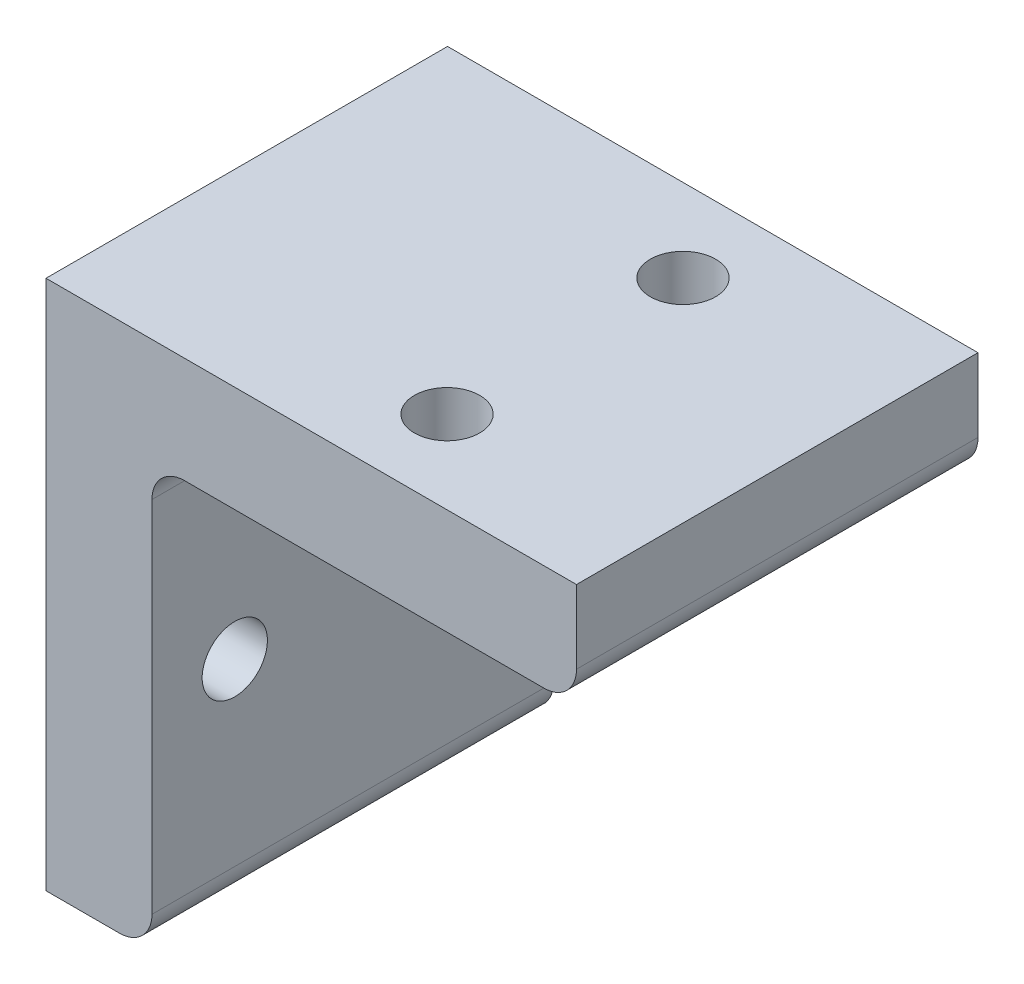
ISO-10303-21;
HEADER;
FILE_DESCRIPTION(('STEP AP214'),'2;1');
FILE_NAME('part.step','',(''),(''),'','','');
FILE_SCHEMA(('AUTOMOTIVE_DESIGN { 1 0 10303 214 1 1 1 1 }'));
ENDSEC;
DATA;
#1=APPLICATION_CONTEXT('core data for automotive mechanical design processes');
#2=APPLICATION_PROTOCOL_DEFINITION('international standard','automotive_design',2000,#1);
#3=PRODUCT_CONTEXT('',#1,'mechanical');
#4=PRODUCT('Part','Part','',(#3));
#5=PRODUCT_RELATED_PRODUCT_CATEGORY('part','',(#4));
#6=PRODUCT_DEFINITION_FORMATION('','',#4);
#7=PRODUCT_DEFINITION_CONTEXT('part definition',#1,'design');
#8=PRODUCT_DEFINITION('design','',#6,#7);
#9=PRODUCT_DEFINITION_SHAPE('','',#8);
#10=(LENGTH_UNIT() NAMED_UNIT(*) SI_UNIT(.MILLI.,.METRE.));
#11=(NAMED_UNIT(*) PLANE_ANGLE_UNIT() SI_UNIT($,.RADIAN.));
#12=(NAMED_UNIT(*) SI_UNIT($,.STERADIAN.) SOLID_ANGLE_UNIT());
#13=UNCERTAINTY_MEASURE_WITH_UNIT(LENGTH_MEASURE(1.E-05),#10,'distance_accuracy_value','');
#14=(GEOMETRIC_REPRESENTATION_CONTEXT(3) GLOBAL_UNCERTAINTY_ASSIGNED_CONTEXT((#13)) GLOBAL_UNIT_ASSIGNED_CONTEXT((#10,
#11,#12)) REPRESENTATION_CONTEXT('',''));
#15=CARTESIAN_POINT('',(0.,0.,0.));
#16=DIRECTION('',(0.,0.,1.));
#17=DIRECTION('',(1.,0.,0.));
#18=AXIS2_PLACEMENT_3D('',#15,#16,#17);
#19=CARTESIAN_POINT('',(8.9916,0.,0.));
#20=DIRECTION('',(-1.,0.,0.));
#21=DIRECTION('',(0.,0.,1.));
#22=AXIS2_PLACEMENT_3D('',#19,#20,#21);
#23=PLANE('',#22);
#24=CARTESIAN_POINT('',(8.9916,-4.49580000000002,-10.0076));
#25=DIRECTION('',(1.,0.,0.));
#26=DIRECTION('',(0.,0.,-1.));
#27=AXIS2_PLACEMENT_3D('',#24,#25,#26);
#28=CIRCLE('',#27,2.6416);
#29=CARTESIAN_POINT('',(8.9916,-4.49580000000002,-12.6492));
#30=VERTEX_POINT('',#29);
#31=EDGE_CURVE('E212',#30,#30,#28,.T.);
#32=ORIENTED_EDGE('',*,*,#31,.F.);
#33=EDGE_LOOP('',(#32));
#34=FACE_BOUND('',#33,.T.);
#35=CARTESIAN_POINT('',(8.9916,-4.49580000000002,10.0076));
#36=DIRECTION('',(1.,0.,0.));
#37=DIRECTION('',(0.,0.,-1.));
#38=AXIS2_PLACEMENT_3D('',#35,#36,#37);
#39=CIRCLE('',#38,2.7686);
#40=CARTESIAN_POINT('',(8.9916,-4.49580000000002,7.23900000000001));
#41=VERTEX_POINT('',#40);
#42=EDGE_CURVE('E206',#41,#41,#39,.T.);
#43=ORIENTED_EDGE('',*,*,#42,.F.);
#44=EDGE_LOOP('',(#43));
#45=FACE_BOUND('',#44,.T.);
#46=DIRECTION('',(0.,-1.,0.));
#47=VECTOR('',#46,1.);
#48=CARTESIAN_POINT('',(8.9916,-22.5,17.0307));
#49=LINE('',#48,#47);
#50=CARTESIAN_POINT('',(8.9916,10.7398,17.0307));
#51=VERTEX_POINT('',#50);
#52=CARTESIAN_POINT('',(8.9916,-19.7314,17.0307));
#53=VERTEX_POINT('',#52);
#54=EDGE_CURVE('E143',#51,#53,#49,.T.);
#55=ORIENTED_EDGE('',*,*,#54,.T.);
#56=DIRECTION('',(0.,0.,-1.));
#57=VECTOR('',#56,1.);
#58=CARTESIAN_POINT('',(8.9916,-19.7314,0.));
#59=LINE('',#58,#57);
#60=CARTESIAN_POINT('',(8.9916,-19.7314,-17.0307));
#61=VERTEX_POINT('',#60);
#62=EDGE_CURVE('E185',#53,#61,#59,.T.);
#63=ORIENTED_EDGE('',*,*,#62,.T.);
#64=DIRECTION('',(0.,1.,0.));
#65=VECTOR('',#64,1.);
#66=CARTESIAN_POINT('',(8.9916,-22.5,-17.0307));
#67=LINE('',#66,#65);
#68=CARTESIAN_POINT('',(8.9916,10.7398,-17.0307));
#69=VERTEX_POINT('',#68);
#70=EDGE_CURVE('E141',#61,#69,#67,.T.);
#71=ORIENTED_EDGE('',*,*,#70,.T.);
#72=DIRECTION('',(0.,0.,-1.));
#73=VECTOR('',#72,1.);
#74=CARTESIAN_POINT('',(8.9916,10.7398,17.0307));
#75=LINE('',#74,#73);
#76=EDGE_CURVE('E55',#69,#51,#75,.F.);
#77=ORIENTED_EDGE('',*,*,#76,.T.);
#78=EDGE_LOOP('',(#55,#63,#71,#77));
#79=FACE_BOUND('',#78,.T.);
#80=ADVANCED_FACE('F33',(#34,#45,#79),#23,.F.);
#81=CARTESIAN_POINT('',(8.9916,-22.5,-17.0307));
#82=DIRECTION('',(0.,0.,1.));
#83=DIRECTION('',(1.,0.,0.));
#84=AXIS2_PLACEMENT_3D('',#81,#82,#83);
#85=PLANE('',#84);
#86=DIRECTION('',(0.,1.,0.));
#87=VECTOR('',#86,1.);
#88=CARTESIAN_POINT('',(45.,22.5,-17.0307));
#89=LINE('',#88,#87);
#90=CARTESIAN_POINT('',(45.,16.277,-17.0307));
#91=VERTEX_POINT('',#90);
#92=CARTESIAN_POINT('',(45.,22.5,-17.0307));
#93=VERTEX_POINT('',#92);
#94=EDGE_CURVE('E106',#91,#93,#89,.T.);
#95=ORIENTED_EDGE('',*,*,#94,.F.);
#96=CARTESIAN_POINT('',(42.2314,16.277,-17.0307));
#97=DIRECTION('',(0.,0.,1.));
#98=DIRECTION('',(1.,0.,0.));
#99=AXIS2_PLACEMENT_3D('',#96,#97,#98);
#100=CIRCLE('',#99,2.7686);
#101=CARTESIAN_POINT('',(42.2314,13.5084,-17.0307));
#102=VERTEX_POINT('',#101);
#103=EDGE_CURVE('E149',#91,#102,#100,.F.);
#104=ORIENTED_EDGE('',*,*,#103,.T.);
#105=DIRECTION('',(-1.,0.,0.));
#106=VECTOR('',#105,1.);
#107=CARTESIAN_POINT('',(45.,13.5084,-17.0307));
#108=LINE('',#107,#106);
#109=CARTESIAN_POINT('',(11.7602,13.5084,-17.0307));
#110=VERTEX_POINT('',#109);
#111=EDGE_CURVE('E129',#102,#110,#108,.T.);
#112=ORIENTED_EDGE('',*,*,#111,.T.);
#113=CARTESIAN_POINT('',(11.7602,10.7398,-17.0307));
#114=DIRECTION('',(0.,0.,1.));
#115=DIRECTION('',(1.,0.,0.));
#116=AXIS2_PLACEMENT_3D('',#113,#114,#115);
#117=CIRCLE('',#116,2.7686);
#118=EDGE_CURVE('E41',#110,#69,#117,.T.);
#119=ORIENTED_EDGE('',*,*,#118,.T.);
#120=ORIENTED_EDGE('',*,*,#70,.F.);
#121=CARTESIAN_POINT('',(6.223,-19.7314,-17.0307));
#122=DIRECTION('',(0.,0.,1.));
#123=DIRECTION('',(1.,0.,0.));
#124=AXIS2_PLACEMENT_3D('',#121,#122,#123);
#125=CIRCLE('',#124,2.7686);
#126=CARTESIAN_POINT('',(6.223,-22.5,-17.0307));
#127=VERTEX_POINT('',#126);
#128=EDGE_CURVE('E147',#61,#127,#125,.F.);
#129=ORIENTED_EDGE('',*,*,#128,.T.);
#130=DIRECTION('',(-1.,0.,0.));
#131=VECTOR('',#130,1.);
#132=CARTESIAN_POINT('',(8.9916,-22.5,-17.0307));
#133=LINE('',#132,#131);
#134=CARTESIAN_POINT('',(0.,-22.5,-17.0307));
#135=VERTEX_POINT('',#134);
#136=EDGE_CURVE('E162',#127,#135,#133,.T.);
#137=ORIENTED_EDGE('',*,*,#136,.T.);
#138=DIRECTION('',(0.,1.,0.));
#139=VECTOR('',#138,1.);
#140=CARTESIAN_POINT('',(0.,-22.5,-17.0307));
#141=LINE('',#140,#139);
#142=CARTESIAN_POINT('',(0.,22.5,-17.0307));
#143=VERTEX_POINT('',#142);
#144=EDGE_CURVE('E123',#135,#143,#141,.T.);
#145=ORIENTED_EDGE('',*,*,#144,.T.);
#146=DIRECTION('',(-1.,0.,0.));
#147=VECTOR('',#146,1.);
#148=CARTESIAN_POINT('',(8.9916,22.5,-17.0307));
#149=LINE('',#148,#147);
#150=EDGE_CURVE('E120',#93,#143,#149,.T.);
#151=ORIENTED_EDGE('',*,*,#150,.F.);
#152=EDGE_LOOP('',(#95,#104,#112,#119,#120,#129,#137,#145,#151));
#153=FACE_BOUND('',#152,.T.);
#154=ADVANCED_FACE('F121',(#153),#85,.F.);
#155=CARTESIAN_POINT('',(8.9916,22.5,17.0307));
#156=DIRECTION('',(0.,-1.,0.));
#157=DIRECTION('',(0.,0.,-1.));
#158=AXIS2_PLACEMENT_3D('',#155,#156,#157);
#159=PLANE('',#158);
#160=CARTESIAN_POINT('',(26.995718,22.5,10.0076));
#161=DIRECTION('',(0.,1.,0.));
#162=DIRECTION('',(0.,0.,1.));
#163=AXIS2_PLACEMENT_3D('',#160,#161,#162);
#164=CIRCLE('',#163,2.7686);
#165=CARTESIAN_POINT('',(26.995718,22.5,12.7762));
#166=VERTEX_POINT('',#165);
#167=EDGE_CURVE('E228',#166,#166,#164,.T.);
#168=ORIENTED_EDGE('',*,*,#167,.F.);
#169=EDGE_LOOP('',(#168));
#170=FACE_BOUND('',#169,.T.);
#171=CARTESIAN_POINT('',(26.995718,22.5,-10.0076));
#172=DIRECTION('',(0.,1.,0.));
#173=DIRECTION('',(0.,0.,1.));
#174=AXIS2_PLACEMENT_3D('',#171,#172,#173);
#175=CIRCLE('',#174,2.7686);
#176=CARTESIAN_POINT('',(26.995718,22.5,-7.23899999999999));
#177=VERTEX_POINT('',#176);
#178=EDGE_CURVE('E222',#177,#177,#175,.T.);
#179=ORIENTED_EDGE('',*,*,#178,.F.);
#180=EDGE_LOOP('',(#179));
#181=FACE_BOUND('',#180,.T.);
#182=DIRECTION('',(0.,0.,1.));
#183=VECTOR('',#182,1.);
#184=CARTESIAN_POINT('',(0.,22.5,17.0307));
#185=LINE('',#184,#183);
#186=CARTESIAN_POINT('',(0.,22.5,17.0307));
#187=VERTEX_POINT('',#186);
#188=EDGE_CURVE('E169',#143,#187,#185,.T.);
#189=ORIENTED_EDGE('',*,*,#188,.T.);
#190=DIRECTION('',(-1.,0.,0.));
#191=VECTOR('',#190,1.);
#192=CARTESIAN_POINT('',(8.9916,22.5,17.0307));
#193=LINE('',#192,#191);
#194=CARTESIAN_POINT('',(45.,22.5,17.0307));
#195=VERTEX_POINT('',#194);
#196=EDGE_CURVE('E125',#195,#187,#193,.T.);
#197=ORIENTED_EDGE('',*,*,#196,.F.);
#198=DIRECTION('',(0.,0.,1.));
#199=VECTOR('',#198,1.);
#200=CARTESIAN_POINT('',(45.,22.5,17.0307));
#201=LINE('',#200,#199);
#202=EDGE_CURVE('E111',#93,#195,#201,.T.);
#203=ORIENTED_EDGE('',*,*,#202,.F.);
#204=ORIENTED_EDGE('',*,*,#150,.T.);
#205=EDGE_LOOP('',(#189,#197,#203,#204));
#206=FACE_BOUND('',#205,.T.);
#207=ADVANCED_FACE('F127',(#170,#181,#206),#159,.F.);
#208=CARTESIAN_POINT('',(8.9916,-22.5,17.0307));
#209=DIRECTION('',(0.,0.,-1.));
#210=DIRECTION('',(-1.,0.,0.));
#211=AXIS2_PLACEMENT_3D('',#208,#209,#210);
#212=PLANE('',#211);
#213=DIRECTION('',(-1.,0.,0.));
#214=VECTOR('',#213,1.);
#215=CARTESIAN_POINT('',(45.,13.5084,17.0307));
#216=LINE('',#215,#214);
#217=CARTESIAN_POINT('',(42.2314,13.5084,17.0307));
#218=VERTEX_POINT('',#217);
#219=CARTESIAN_POINT('',(11.7602,13.5084,17.0307));
#220=VERTEX_POINT('',#219);
#221=EDGE_CURVE('E132',#218,#220,#216,.T.);
#222=ORIENTED_EDGE('',*,*,#221,.F.);
#223=CARTESIAN_POINT('',(42.2314,16.277,17.0307));
#224=DIRECTION('',(0.,0.,-1.));
#225=DIRECTION('',(-1.,0.,0.));
#226=AXIS2_PLACEMENT_3D('',#223,#224,#225);
#227=CIRCLE('',#226,2.7686);
#228=CARTESIAN_POINT('',(45.,16.277,17.0307));
#229=VERTEX_POINT('',#228);
#230=EDGE_CURVE('E186',#218,#229,#227,.F.);
#231=ORIENTED_EDGE('',*,*,#230,.T.);
#232=DIRECTION('',(0.,-1.,0.));
#233=VECTOR('',#232,1.);
#234=CARTESIAN_POINT('',(45.,22.5,17.0307));
#235=LINE('',#234,#233);
#236=EDGE_CURVE('E116',#195,#229,#235,.T.);
#237=ORIENTED_EDGE('',*,*,#236,.F.);
#238=ORIENTED_EDGE('',*,*,#196,.T.);
#239=DIRECTION('',(0.,-1.,0.));
#240=VECTOR('',#239,1.);
#241=CARTESIAN_POINT('',(0.,-22.5,17.0307));
#242=LINE('',#241,#240);
#243=CARTESIAN_POINT('',(0.,-22.5,17.0307));
#244=VERTEX_POINT('',#243);
#245=EDGE_CURVE('E166',#187,#244,#242,.T.);
#246=ORIENTED_EDGE('',*,*,#245,.T.);
#247=DIRECTION('',(-1.,0.,0.));
#248=VECTOR('',#247,1.);
#249=CARTESIAN_POINT('',(8.9916,-22.5,17.0307));
#250=LINE('',#249,#248);
#251=CARTESIAN_POINT('',(6.223,-22.5,17.0307));
#252=VERTEX_POINT('',#251);
#253=EDGE_CURVE('E160',#252,#244,#250,.T.);
#254=ORIENTED_EDGE('',*,*,#253,.F.);
#255=CARTESIAN_POINT('',(6.223,-19.7314,17.0307));
#256=DIRECTION('',(0.,0.,-1.));
#257=DIRECTION('',(-1.,0.,0.));
#258=AXIS2_PLACEMENT_3D('',#255,#256,#257);
#259=CIRCLE('',#258,2.7686);
#260=EDGE_CURVE('E48',#252,#53,#259,.F.);
#261=ORIENTED_EDGE('',*,*,#260,.T.);
#262=ORIENTED_EDGE('',*,*,#54,.F.);
#263=CARTESIAN_POINT('',(11.7602,10.7398,17.0307));
#264=DIRECTION('',(0.,0.,-1.));
#265=DIRECTION('',(-1.,0.,0.));
#266=AXIS2_PLACEMENT_3D('',#263,#264,#265);
#267=CIRCLE('',#266,2.7686);
#268=EDGE_CURVE('E11',#51,#220,#267,.T.);
#269=ORIENTED_EDGE('',*,*,#268,.T.);
#270=EDGE_LOOP('',(#222,#231,#237,#238,#246,#254,#261,#262,#269));
#271=FACE_BOUND('',#270,.T.);
#272=ADVANCED_FACE('F173',(#271),#212,.F.);
#273=CARTESIAN_POINT('',(8.9916,-22.5,17.0307));
#274=DIRECTION('',(0.,1.,0.));
#275=DIRECTION('',(0.,0.,1.));
#276=AXIS2_PLACEMENT_3D('',#273,#274,#275);
#277=PLANE('',#276);
#278=ORIENTED_EDGE('',*,*,#136,.F.);
#279=DIRECTION('',(0.,0.,-1.));
#280=VECTOR('',#279,1.);
#281=CARTESIAN_POINT('',(6.223,-22.5,17.0307));
#282=LINE('',#281,#280);
#283=EDGE_CURVE('E180',#127,#252,#282,.F.);
#284=ORIENTED_EDGE('',*,*,#283,.T.);
#285=ORIENTED_EDGE('',*,*,#253,.T.);
#286=DIRECTION('',(0.,0.,-1.));
#287=VECTOR('',#286,1.);
#288=CARTESIAN_POINT('',(0.,-22.5,17.0307));
#289=LINE('',#288,#287);
#290=EDGE_CURVE('E144',#244,#135,#289,.T.);
#291=ORIENTED_EDGE('',*,*,#290,.T.);
#292=EDGE_LOOP('',(#278,#284,#285,#291));
#293=FACE_BOUND('',#292,.T.);
#294=ADVANCED_FACE('F178',(#293),#277,.F.);
#295=CARTESIAN_POINT('',(0.,0.,0.));
#296=DIRECTION('',(-1.,0.,0.));
#297=DIRECTION('',(0.,0.,1.));
#298=AXIS2_PLACEMENT_3D('',#295,#296,#297);
#299=PLANE('',#298);
#300=CARTESIAN_POINT('',(0.,-4.49580000000002,-10.0076));
#301=DIRECTION('',(-1.,0.,0.));
#302=DIRECTION('',(0.,0.,1.));
#303=AXIS2_PLACEMENT_3D('',#300,#301,#302);
#304=CIRCLE('',#303,2.6416);
#305=CARTESIAN_POINT('',(0.,-4.49580000000002,-7.36599999999999));
#306=VERTEX_POINT('',#305);
#307=EDGE_CURVE('E214',#306,#306,#304,.F.);
#308=ORIENTED_EDGE('',*,*,#307,.T.);
#309=EDGE_LOOP('',(#308));
#310=FACE_BOUND('',#309,.T.);
#311=CARTESIAN_POINT('',(0.,-4.49580000000002,10.0076));
#312=DIRECTION('',(-1.,0.,0.));
#313=DIRECTION('',(0.,0.,1.));
#314=AXIS2_PLACEMENT_3D('',#311,#312,#313);
#315=CIRCLE('',#314,2.7686);
#316=CARTESIAN_POINT('',(0.,-4.49580000000002,12.7762));
#317=VERTEX_POINT('',#316);
#318=EDGE_CURVE('E208',#317,#317,#315,.F.);
#319=ORIENTED_EDGE('',*,*,#318,.T.);
#320=EDGE_LOOP('',(#319));
#321=FACE_BOUND('',#320,.T.);
#322=ORIENTED_EDGE('',*,*,#144,.F.);
#323=ORIENTED_EDGE('',*,*,#290,.F.);
#324=ORIENTED_EDGE('',*,*,#245,.F.);
#325=ORIENTED_EDGE('',*,*,#188,.F.);
#326=EDGE_LOOP('',(#322,#323,#324,#325));
#327=FACE_BOUND('',#326,.T.);
#328=ADVANCED_FACE('F175',(#310,#321,#327),#299,.T.);
#329=CARTESIAN_POINT('',(45.,13.5084,17.0307));
#330=DIRECTION('',(0.,1.,0.));
#331=DIRECTION('',(0.,0.,1.));
#332=AXIS2_PLACEMENT_3D('',#329,#330,#331);
#333=PLANE('',#332);
#334=CARTESIAN_POINT('',(26.995718,13.5084,10.0076));
#335=DIRECTION('',(0.,1.,0.));
#336=DIRECTION('',(0.,0.,1.));
#337=AXIS2_PLACEMENT_3D('',#334,#335,#336);
#338=CIRCLE('',#337,2.7686);
#339=CARTESIAN_POINT('',(26.995718,13.5084,12.7762));
#340=VERTEX_POINT('',#339);
#341=EDGE_CURVE('E225',#340,#340,#338,.F.);
#342=ORIENTED_EDGE('',*,*,#341,.F.);
#343=EDGE_LOOP('',(#342));
#344=FACE_BOUND('',#343,.T.);
#345=CARTESIAN_POINT('',(26.995718,13.5084,-10.0076));
#346=DIRECTION('',(0.,1.,0.));
#347=DIRECTION('',(0.,0.,1.));
#348=AXIS2_PLACEMENT_3D('',#345,#346,#347);
#349=CIRCLE('',#348,2.7686);
#350=CARTESIAN_POINT('',(26.995718,13.5084,-7.23899999999999));
#351=VERTEX_POINT('',#350);
#352=EDGE_CURVE('E217',#351,#351,#349,.F.);
#353=ORIENTED_EDGE('',*,*,#352,.F.);
#354=EDGE_LOOP('',(#353));
#355=FACE_BOUND('',#354,.T.);
#356=ORIENTED_EDGE('',*,*,#111,.F.);
#357=DIRECTION('',(0.,0.,-1.));
#358=VECTOR('',#357,1.);
#359=CARTESIAN_POINT('',(42.2314,13.5084,17.0307));
#360=LINE('',#359,#358);
#361=EDGE_CURVE('E187',#102,#218,#360,.F.);
#362=ORIENTED_EDGE('',*,*,#361,.T.);
#363=ORIENTED_EDGE('',*,*,#221,.T.);
#364=DIRECTION('',(0.,0.,-1.));
#365=VECTOR('',#364,1.);
#366=CARTESIAN_POINT('',(11.7602,13.5084,-17.0307));
#367=LINE('',#366,#365);
#368=EDGE_CURVE('E151',#220,#110,#367,.T.);
#369=ORIENTED_EDGE('',*,*,#368,.T.);
#370=EDGE_LOOP('',(#356,#362,#363,#369));
#371=FACE_BOUND('',#370,.T.);
#372=ADVANCED_FACE('F202',(#344,#355,#371),#333,.F.);
#373=CARTESIAN_POINT('',(45.,0.,0.));
#374=DIRECTION('',(1.,0.,0.));
#375=DIRECTION('',(0.,0.,-1.));
#376=AXIS2_PLACEMENT_3D('',#373,#374,#375);
#377=PLANE('',#376);
#378=ORIENTED_EDGE('',*,*,#236,.T.);
#379=DIRECTION('',(0.,0.,-1.));
#380=VECTOR('',#379,1.);
#381=CARTESIAN_POINT('',(45.,16.277,-17.0307));
#382=LINE('',#381,#380);
#383=EDGE_CURVE('E114',#229,#91,#382,.T.);
#384=ORIENTED_EDGE('',*,*,#383,.T.);
#385=ORIENTED_EDGE('',*,*,#94,.T.);
#386=ORIENTED_EDGE('',*,*,#202,.T.);
#387=EDGE_LOOP('',(#378,#384,#385,#386));
#388=FACE_BOUND('',#387,.T.);
#389=ADVANCED_FACE('F109',(#388),#377,.T.);
#390=CARTESIAN_POINT('',(-0.000999999999999265,-4.49580000000002,10.0076));
#391=DIRECTION('',(1.,0.,0.));
#392=DIRECTION('',(0.,0.,-1.));
#393=AXIS2_PLACEMENT_3D('',#390,#391,#392);
#394=CYLINDRICAL_SURFACE('',#393,2.7686);
#395=ORIENTED_EDGE('',*,*,#318,.F.);
#396=EDGE_LOOP('',(#395));
#397=FACE_BOUND('',#396,.T.);
#398=ORIENTED_EDGE('',*,*,#42,.T.);
#399=EDGE_LOOP('',(#398));
#400=FACE_BOUND('',#399,.T.);
#401=ADVANCED_FACE('F254',(#397,#400),#394,.F.);
#402=CARTESIAN_POINT('',(-0.000999999999999265,-4.49580000000002,-10.0076));
#403=DIRECTION('',(1.,0.,0.));
#404=DIRECTION('',(0.,0.,-1.));
#405=AXIS2_PLACEMENT_3D('',#402,#403,#404);
#406=CYLINDRICAL_SURFACE('',#405,2.6416);
#407=ORIENTED_EDGE('',*,*,#307,.F.);
#408=EDGE_LOOP('',(#407));
#409=FACE_BOUND('',#408,.T.);
#410=ORIENTED_EDGE('',*,*,#31,.T.);
#411=EDGE_LOOP('',(#410));
#412=FACE_BOUND('',#411,.T.);
#413=ADVANCED_FACE('F243',(#409,#412),#406,.F.);
#414=CARTESIAN_POINT('',(26.995718,-22.501025,-10.0076));
#415=DIRECTION('',(0.,1.,0.));
#416=DIRECTION('',(0.,0.,1.));
#417=AXIS2_PLACEMENT_3D('',#414,#415,#416);
#418=CYLINDRICAL_SURFACE('',#417,2.7686);
#419=ORIENTED_EDGE('',*,*,#178,.T.);
#420=EDGE_LOOP('',(#419));
#421=FACE_BOUND('',#420,.T.);
#422=ORIENTED_EDGE('',*,*,#352,.T.);
#423=EDGE_LOOP('',(#422));
#424=FACE_BOUND('',#423,.T.);
#425=ADVANCED_FACE('F240',(#421,#424),#418,.F.);
#426=CARTESIAN_POINT('',(26.995718,-22.501025,10.0076));
#427=DIRECTION('',(0.,1.,0.));
#428=DIRECTION('',(0.,0.,1.));
#429=AXIS2_PLACEMENT_3D('',#426,#427,#428);
#430=CYLINDRICAL_SURFACE('',#429,2.7686);
#431=ORIENTED_EDGE('',*,*,#167,.T.);
#432=EDGE_LOOP('',(#431));
#433=FACE_BOUND('',#432,.T.);
#434=ORIENTED_EDGE('',*,*,#341,.T.);
#435=EDGE_LOOP('',(#434));
#436=FACE_BOUND('',#435,.T.);
#437=ADVANCED_FACE('F232',(#433,#436),#430,.F.);
#438=CARTESIAN_POINT('',(42.2314,16.277,0.));
#439=DIRECTION('',(0.,0.,1.));
#440=DIRECTION('',(0.,-1.,0.));
#441=AXIS2_PLACEMENT_3D('',#438,#439,#440);
#442=CYLINDRICAL_SURFACE('',#441,2.7686);
#443=ORIENTED_EDGE('',*,*,#230,.F.);
#444=ORIENTED_EDGE('',*,*,#361,.F.);
#445=ORIENTED_EDGE('',*,*,#103,.F.);
#446=ORIENTED_EDGE('',*,*,#383,.F.);
#447=EDGE_LOOP('',(#443,#444,#445,#446));
#448=FACE_BOUND('',#447,.T.);
#449=ADVANCED_FACE('F205',(#448),#442,.T.);
#450=CARTESIAN_POINT('',(6.223,-19.7314,0.));
#451=DIRECTION('',(0.,0.,-1.));
#452=DIRECTION('',(-1.,0.,0.));
#453=AXIS2_PLACEMENT_3D('',#450,#451,#452);
#454=CYLINDRICAL_SURFACE('',#453,2.7686);
#455=ORIENTED_EDGE('',*,*,#260,.F.);
#456=ORIENTED_EDGE('',*,*,#283,.F.);
#457=ORIENTED_EDGE('',*,*,#128,.F.);
#458=ORIENTED_EDGE('',*,*,#62,.F.);
#459=EDGE_LOOP('',(#455,#456,#457,#458));
#460=FACE_BOUND('',#459,.T.);
#461=ADVANCED_FACE('F183',(#460),#454,.T.);
#462=CARTESIAN_POINT('',(11.7602,10.7398,17.0307));
#463=DIRECTION('',(0.,0.,1.));
#464=DIRECTION('',(0.,-1.,0.));
#465=AXIS2_PLACEMENT_3D('',#462,#463,#464);
#466=CYLINDRICAL_SURFACE('',#465,2.7686);
#467=ORIENTED_EDGE('',*,*,#268,.F.);
#468=ORIENTED_EDGE('',*,*,#76,.F.);
#469=ORIENTED_EDGE('',*,*,#118,.F.);
#470=ORIENTED_EDGE('',*,*,#368,.F.);
#471=EDGE_LOOP('',(#467,#468,#469,#470));
#472=FACE_BOUND('',#471,.T.);
#473=ADVANCED_FACE('F35',(#472),#466,.F.);
#474=CLOSED_SHELL('',(#80,#154,#207,#272,#294,#328,#372,#389,#401,#413,#425,#437,#449,#461,#473));
#475=MANIFOLD_SOLID_BREP('B2',#474);
#476=ADVANCED_BREP_SHAPE_REPRESENTATION('',(#18,#475),#14);
#477=SHAPE_DEFINITION_REPRESENTATION(#9,#476);
ENDSEC;
END-ISO-10303-21;
